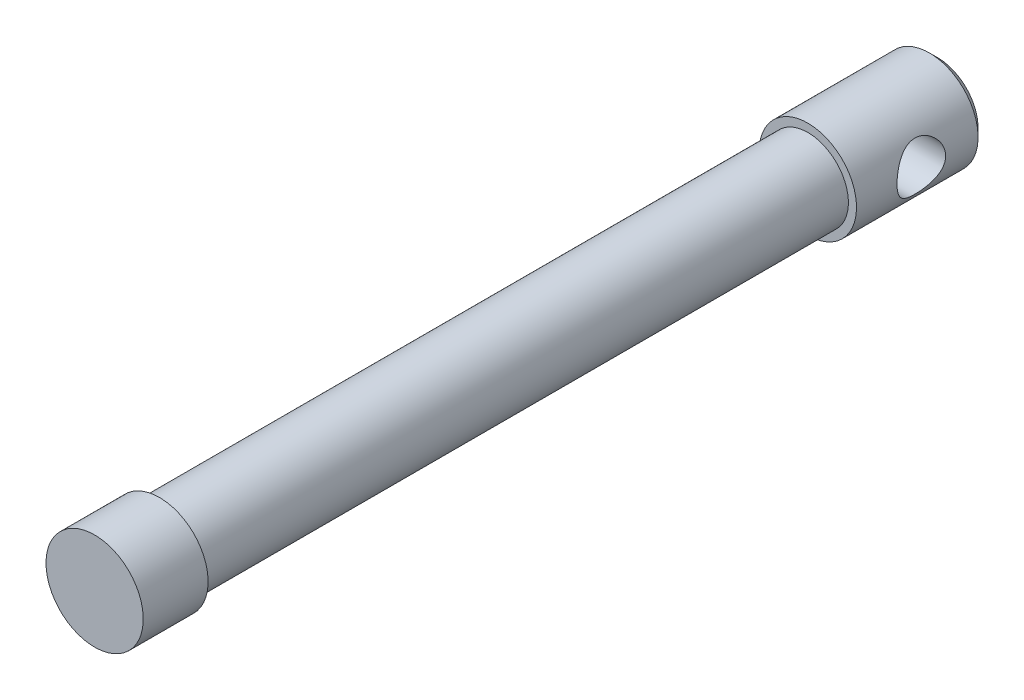
ISO-10303-21;
HEADER;
FILE_DESCRIPTION(('STEP AP214'),'2;1');
FILE_NAME('part.step','',(''),(''),'','','');
FILE_SCHEMA(('AUTOMOTIVE_DESIGN { 1 0 10303 214 1 1 1 1 }'));
ENDSEC;
DATA;
#1=APPLICATION_CONTEXT('core data for automotive mechanical design processes');
#2=APPLICATION_PROTOCOL_DEFINITION('international standard','automotive_design',2000,#1);
#3=PRODUCT_CONTEXT('',#1,'mechanical');
#4=PRODUCT('Part','Part','',(#3));
#5=PRODUCT_RELATED_PRODUCT_CATEGORY('part','',(#4));
#6=PRODUCT_DEFINITION_FORMATION('','',#4);
#7=PRODUCT_DEFINITION_CONTEXT('part definition',#1,'design');
#8=PRODUCT_DEFINITION('design','',#6,#7);
#9=PRODUCT_DEFINITION_SHAPE('','',#8);
#10=(LENGTH_UNIT() NAMED_UNIT(*) SI_UNIT(.MILLI.,.METRE.));
#11=(NAMED_UNIT(*) PLANE_ANGLE_UNIT() SI_UNIT($,.RADIAN.));
#12=(NAMED_UNIT(*) SI_UNIT($,.STERADIAN.) SOLID_ANGLE_UNIT());
#13=UNCERTAINTY_MEASURE_WITH_UNIT(LENGTH_MEASURE(1.E-05),#10,'distance_accuracy_value','');
#14=(GEOMETRIC_REPRESENTATION_CONTEXT(3) GLOBAL_UNCERTAINTY_ASSIGNED_CONTEXT((#13)) GLOBAL_UNIT_ASSIGNED_CONTEXT((#10,
#11,#12)) REPRESENTATION_CONTEXT('',''));
#15=CARTESIAN_POINT('',(0.,0.,0.));
#16=DIRECTION('',(0.,0.,1.));
#17=DIRECTION('',(1.,0.,0.));
#18=AXIS2_PLACEMENT_3D('',#15,#16,#17);
#19=CARTESIAN_POINT('',(0.,0.,0.));
#20=DIRECTION('',(0.,0.,-1.));
#21=DIRECTION('',(-1.,0.,0.));
#22=AXIS2_PLACEMENT_3D('',#19,#20,#21);
#23=PLANE('',#22);
#24=CARTESIAN_POINT('',(0.,0.,0.));
#25=DIRECTION('',(0.,0.,1.));
#26=DIRECTION('',(1.,0.,0.));
#27=AXIS2_PLACEMENT_3D('',#24,#25,#26);
#28=CIRCLE('',#27,9.525);
#29=CARTESIAN_POINT('',(-9.525,0.,0.));
#30=VERTEX_POINT('',#29);
#31=EDGE_CURVE('E112',#30,#30,#28,.T.);
#32=ORIENTED_EDGE('',*,*,#31,.T.);
#33=EDGE_LOOP('',(#32));
#34=FACE_BOUND('',#33,.T.);
#35=ADVANCED_FACE('F40',(#34),#23,.F.);
#36=CARTESIAN_POINT('',(0.,0.,-12.7));
#37=DIRECTION('',(0.,0.,-1.));
#38=DIRECTION('',(-1.,0.,0.));
#39=AXIS2_PLACEMENT_3D('',#36,#37,#38);
#40=PLANE('',#39);
#41=CARTESIAN_POINT('',(0.,0.,-12.7));
#42=DIRECTION('',(0.,0.,-1.));
#43=DIRECTION('',(-1.,0.,0.));
#44=AXIS2_PLACEMENT_3D('',#41,#42,#43);
#45=CIRCLE('',#44,7.9375);
#46=CARTESIAN_POINT('',(-7.9375,0.,-12.7));
#47=VERTEX_POINT('',#46);
#48=EDGE_CURVE('E120',#47,#47,#45,.T.);
#49=ORIENTED_EDGE('',*,*,#48,.F.);
#50=EDGE_LOOP('',(#49));
#51=FACE_BOUND('',#50,.T.);
#52=CARTESIAN_POINT('',(0.,0.,-12.7));
#53=DIRECTION('',(0.,0.,1.));
#54=DIRECTION('',(1.,0.,0.));
#55=AXIS2_PLACEMENT_3D('',#52,#53,#54);
#56=CIRCLE('',#55,9.525);
#57=CARTESIAN_POINT('',(-9.525,0.,-12.7));
#58=VERTEX_POINT('',#57);
#59=EDGE_CURVE('E114',#58,#58,#56,.T.);
#60=ORIENTED_EDGE('',*,*,#59,.F.);
#61=EDGE_LOOP('',(#60));
#62=FACE_BOUND('',#61,.T.);
#63=ADVANCED_FACE('F95',(#51,#62),#40,.T.);
#64=CARTESIAN_POINT('',(0.,0.,0.));
#65=DIRECTION('',(0.,0.,-1.));
#66=DIRECTION('',(-1.,0.,0.));
#67=AXIS2_PLACEMENT_3D('',#64,#65,#66);
#68=CYLINDRICAL_SURFACE('',#67,9.525);
#69=CARTESIAN_POINT('',(-9.525,0.,0.));
#70=CARTESIAN_POINT('',(-9.525,0.,-0.132291666666667));
#71=CARTESIAN_POINT('',(-9.525,0.,-0.264583333333333));
#72=CARTESIAN_POINT('',(-9.525,0.,-0.529166666666666));
#73=CARTESIAN_POINT('',(-9.525,0.,-0.661458333333333));
#74=CARTESIAN_POINT('',(-9.525,0.,-0.926041666666667));
#75=CARTESIAN_POINT('',(-9.525,0.,-1.05833333333333));
#76=CARTESIAN_POINT('',(-9.525,0.,-1.32291666666667));
#77=CARTESIAN_POINT('',(-9.525,0.,-1.45520833333333));
#78=CARTESIAN_POINT('',(-9.525,0.,-1.71979166666667));
#79=CARTESIAN_POINT('',(-9.525,0.,-1.85208333333333));
#80=CARTESIAN_POINT('',(-9.525,0.,-2.11666666666667));
#81=CARTESIAN_POINT('',(-9.525,0.,-2.24895833333333));
#82=CARTESIAN_POINT('',(-9.525,0.,-2.51354166666667));
#83=CARTESIAN_POINT('',(-9.525,0.,-2.64583333333333));
#84=CARTESIAN_POINT('',(-9.525,0.,-2.91041666666667));
#85=CARTESIAN_POINT('',(-9.525,0.,-3.04270833333333));
#86=CARTESIAN_POINT('',(-9.525,0.,-3.30729166666667));
#87=CARTESIAN_POINT('',(-9.525,0.,-3.43958333333333));
#88=CARTESIAN_POINT('',(-9.525,0.,-3.70416666666667));
#89=CARTESIAN_POINT('',(-9.525,0.,-3.83645833333333));
#90=CARTESIAN_POINT('',(-9.525,0.,-4.10104166666667));
#91=CARTESIAN_POINT('',(-9.525,0.,-4.23333333333333));
#92=CARTESIAN_POINT('',(-9.525,0.,-4.49791666666667));
#93=CARTESIAN_POINT('',(-9.525,0.,-4.63020833333333));
#94=CARTESIAN_POINT('',(-9.525,0.,-4.89479166666667));
#95=CARTESIAN_POINT('',(-9.525,0.,-5.02708333333333));
#96=CARTESIAN_POINT('',(-9.525,0.,-5.29166666666667));
#97=CARTESIAN_POINT('',(-9.525,0.,-5.42395833333333));
#98=CARTESIAN_POINT('',(-9.525,0.,-5.68854166666667));
#99=CARTESIAN_POINT('',(-9.525,0.,-5.82083333333333));
#100=CARTESIAN_POINT('',(-9.525,0.,-6.08541666666667));
#101=CARTESIAN_POINT('',(-9.525,0.,-6.21770833333333));
#102=CARTESIAN_POINT('',(-9.525,0.,-6.48229166666667));
#103=CARTESIAN_POINT('',(-9.525,0.,-6.61458333333333));
#104=CARTESIAN_POINT('',(-9.525,0.,-6.87916666666667));
#105=CARTESIAN_POINT('',(-9.525,0.,-7.01145833333333));
#106=CARTESIAN_POINT('',(-9.525,0.,-7.27604166666667));
#107=CARTESIAN_POINT('',(-9.525,0.,-7.40833333333333));
#108=CARTESIAN_POINT('',(-9.525,0.,-7.67291666666667));
#109=CARTESIAN_POINT('',(-9.525,0.,-7.80520833333333));
#110=CARTESIAN_POINT('',(-9.525,0.,-8.06979166666667));
#111=CARTESIAN_POINT('',(-9.525,0.,-8.20208333333333));
#112=CARTESIAN_POINT('',(-9.525,0.,-8.46666666666667));
#113=CARTESIAN_POINT('',(-9.525,0.,-8.59895833333333));
#114=CARTESIAN_POINT('',(-9.525,0.,-8.86354166666666));
#115=CARTESIAN_POINT('',(-9.525,0.,-8.99583333333333));
#116=CARTESIAN_POINT('',(-9.525,0.,-9.26041666666666));
#117=CARTESIAN_POINT('',(-9.525,0.,-9.39270833333333));
#118=CARTESIAN_POINT('',(-9.525,0.,-9.65729166666667));
#119=CARTESIAN_POINT('',(-9.525,0.,-9.78958333333333));
#120=CARTESIAN_POINT('',(-9.525,0.,-10.0541666666667));
#121=CARTESIAN_POINT('',(-9.525,0.,-10.1864583333333));
#122=CARTESIAN_POINT('',(-9.525,0.,-10.4510416666667));
#123=CARTESIAN_POINT('',(-9.525,0.,-10.5833333333333));
#124=CARTESIAN_POINT('',(-9.525,0.,-10.8479166666667));
#125=CARTESIAN_POINT('',(-9.525,0.,-10.9802083333333));
#126=CARTESIAN_POINT('',(-9.525,0.,-11.2447916666667));
#127=CARTESIAN_POINT('',(-9.525,0.,-11.3770833333333));
#128=CARTESIAN_POINT('',(-9.525,0.,-11.6416666666667));
#129=CARTESIAN_POINT('',(-9.525,0.,-11.7739583333333));
#130=CARTESIAN_POINT('',(-9.525,0.,-12.0385416666667));
#131=CARTESIAN_POINT('',(-9.525,0.,-12.1708333333333));
#132=CARTESIAN_POINT('',(-9.525,0.,-12.4354166666667));
#133=CARTESIAN_POINT('',(-9.525,0.,-12.5677083333333));
#134=CARTESIAN_POINT('',(-9.525,0.,-12.7));
#135=B_SPLINE_CURVE_WITH_KNOTS('',3,(#69,#70,#71,#72,#73,#74,#75,#76,#77,#78,#79,#80,#81,#82,
#83,#84,#85,#86,#87,#88,#89,#90,#91,#92,#93,#94,#95,#96,#97,#98,#99,#100,#101,#102,#103,#104,
#105,#106,#107,#108,#109,#110,#111,#112,#113,#114,#115,#116,#117,#118,#119,#120,#121,#122,#123,
#124,#125,#126,#127,#128,#129,#130,#131,#132,#133,#134),.UNSPECIFIED.,.F.,.F.,(4,2,2,2,2,2,2,2,
2,2,2,2,2,2,2,2,2,2,2,2,2,2,2,2,2,2,2,2,2,2,2,2,4),(0.,0.396875,0.79375,1.190625,1.5875,
1.984375,2.38125,2.778125,3.175,3.571875,3.96875,4.365625,4.7625,5.159375,5.55625,5.953125,6.35,
6.746875,7.14375,7.540625,7.9375,8.334375,8.73125,9.128125,9.525,9.921875,10.31875,10.715625,
11.1125,11.509375,11.90625,12.303125,12.7),.UNSPECIFIED.);
#136=EDGE_CURVE('BSEAM92',#30,#58,#135,.T.);
#137=ORIENTED_EDGE('',*,*,#31,.F.);
#138=ORIENTED_EDGE('',*,*,#59,.T.);
#139=ORIENTED_EDGE('',*,*,#136,.T.);
#140=ORIENTED_EDGE('',*,*,#136,.F.);
#141=EDGE_LOOP('',(#137,#139,#138,#140));
#142=FACE_BOUND('',#141,.T.);
#143=ADVANCED_FACE('F92',(#142),#68,.T.);
#144=CARTESIAN_POINT('',(0.,0.,-139.7));
#145=DIRECTION('',(0.,0.,1.));
#146=DIRECTION('',(1.,0.,0.));
#147=AXIS2_PLACEMENT_3D('',#144,#145,#146);
#148=CYLINDRICAL_SURFACE('',#147,7.9375);
#149=CARTESIAN_POINT('',(0.,0.,-139.7));
#150=DIRECTION('',(0.,0.,-1.));
#151=DIRECTION('',(-1.,0.,0.));
#152=AXIS2_PLACEMENT_3D('',#149,#150,#151);
#153=CIRCLE('',#152,7.9375);
#154=CARTESIAN_POINT('',(-7.9375,0.,-139.7));
#155=VERTEX_POINT('',#154);
#156=EDGE_CURVE('E115',#155,#155,#153,.T.);
#157=ORIENTED_EDGE('',*,*,#156,.F.);
#158=EDGE_LOOP('',(#157));
#159=FACE_BOUND('',#158,.T.);
#160=ORIENTED_EDGE('',*,*,#48,.T.);
#161=EDGE_LOOP('',(#160));
#162=FACE_BOUND('',#161,.T.);
#163=ADVANCED_FACE('F94',(#159,#162),#148,.T.);
#164=CARTESIAN_POINT('',(0.,0.,-165.1));
#165=DIRECTION('',(0.,0.,1.));
#166=DIRECTION('',(1.,0.,0.));
#167=AXIS2_PLACEMENT_3D('',#164,#165,#166);
#168=CYLINDRICAL_SURFACE('',#167,9.525);
#169=CARTESIAN_POINT('',(-9.525,0.,-157.1625));
#170=CARTESIAN_POINT('',(-9.52499962063721,0.12524316779999,-157.162499588314));
#171=CARTESIAN_POINT('',(-9.52252400598023,0.250495089131836,-157.157553881541));
#172=CARTESIAN_POINT('',(-9.51268396387997,0.500076393496527,-157.137827493358));
#173=CARTESIAN_POINT('',(-9.50531740964971,0.624405351393148,-157.12304253342));
#174=CARTESIAN_POINT('',(-9.48587193787975,0.87133100126815,-157.083784657548));
#175=CARTESIAN_POINT('',(-9.47378630044847,0.9939249635233,-157.059297925728));
#176=CARTESIAN_POINT('',(-9.44520637539277,1.23637011508467,-157.000907734383));
#177=CARTESIAN_POINT('',(-9.42871028557932,1.35622016139572,-156.967000425221));
#178=CARTESIAN_POINT('',(-9.39179697222459,1.59183120722172,-156.890295995465));
#179=CARTESIAN_POINT('',(-9.37139708461428,1.70760770137534,-156.847538112257));
#180=CARTESIAN_POINT('',(-9.3271126718355,1.93495086483046,-156.75345002009));
#181=CARTESIAN_POINT('',(-9.30322683559748,2.04651593025001,-156.702116584799));
#182=CARTESIAN_POINT('',(-9.22716144615755,2.37384489745524,-156.535945853429));
#183=CARTESIAN_POINT('',(-9.17053150857179,2.58250225923314,-156.408852688455));
#184=CARTESIAN_POINT('',(-9.04666081910159,2.98854538583361,-156.117030969651));
#185=CARTESIAN_POINT('',(-8.97898540114139,3.1844855631296,-155.950490717651));
#186=CARTESIAN_POINT('',(-8.84205954293001,3.54699697455441,-155.588408893268));
#187=CARTESIAN_POINT('',(-8.77280794740667,3.71354582861884,-155.392845427927));
#188=CARTESIAN_POINT('',(-8.63435408613186,4.02553537328568,-154.959867422615));
#189=CARTESIAN_POINT('',(-8.56557212539103,4.16833749963764,-154.720383450744));
#190=CARTESIAN_POINT('',(-8.47379640254791,4.35029005345509,-154.343178061627));
#191=CARTESIAN_POINT('',(-8.4450962651909,4.40557901885788,-154.214399825047));
#192=CARTESIAN_POINT('',(-8.39256904955603,4.50483773649695,-153.951621310878));
#193=CARTESIAN_POINT('',(-8.36873908777993,4.54881419057648,-153.817624179539));
#194=CARTESIAN_POINT('',(-8.32818911059644,4.6226139958286,-153.553484390703));
#195=CARTESIAN_POINT('',(-8.31113119648638,4.65312214328155,-153.423584578092));
#196=CARTESIAN_POINT('',(-8.28290506375683,4.70318378391282,-153.161118312858));
#197=CARTESIAN_POINT('',(-8.27173372047612,4.72274308921004,-153.028553313823));
#198=CARTESIAN_POINT('',(-8.25575723957704,4.7506165346424,-152.761942745545));
#199=CARTESIAN_POINT('',(-8.25094826797975,4.75893744712048,-152.627898117086));
#200=CARTESIAN_POINT('',(-8.2479001730778,4.76421854927813,-152.359518180681));
#201=CARTESIAN_POINT('',(-8.24966042295241,4.76117982286955,-152.225182901689));
#202=CARTESIAN_POINT('',(-8.2590684278093,4.74483797280582,-151.973560536947));
#203=CARTESIAN_POINT('',(-8.2659846789569,4.73280973448219,-151.856161267269));
#204=CARTESIAN_POINT('',(-8.28459407928506,4.70015601149781,-151.622936674255));
#205=CARTESIAN_POINT('',(-8.29628872876442,4.67952782662533,-151.507111857071));
#206=CARTESIAN_POINT('',(-8.33800444414717,4.60506661909893,-151.163203594897));
#207=CARTESIAN_POINT('',(-8.37466460391199,4.53864529577751,-150.938513221415));
#208=CARTESIAN_POINT('',(-8.46236620531704,4.37297035741613,-150.498635772543));
#209=CARTESIAN_POINT('',(-8.51372273880603,4.27298801966148,-150.283791964974));
#210=CARTESIAN_POINT('',(-8.62505005190894,4.04355977442938,-149.872862496087));
#211=CARTESIAN_POINT('',(-8.68502469635284,3.914100632641,-149.676785316827));
#212=CARTESIAN_POINT('',(-8.81601207894059,3.6102994781272,-149.282845068965));
#213=CARTESIAN_POINT('',(-8.88746017331488,3.43234782914615,-149.087907979856));
#214=CARTESIAN_POINT('',(-9.02721381532401,3.04584295330873,-148.72935121853));
#215=CARTESIAN_POINT('',(-9.0955178493011,2.83727518509306,-148.565746513439));
#216=CARTESIAN_POINT('',(-9.19195370403877,2.49965137796344,-148.343834673363));
#217=CARTESIAN_POINT('',(-9.22372787983903,2.38002127368373,-148.272482029683));
#218=CARTESIAN_POINT('',(-9.28366556941997,2.13427687141612,-148.140221786318));
#219=CARTESIAN_POINT('',(-9.31183060399966,2.00816533613018,-148.07930978354));
#220=CARTESIAN_POINT('',(-9.36371844925579,1.75034069526616,-147.968590044518));
#221=CARTESIAN_POINT('',(-9.38744304755807,1.61862987016266,-147.918777838185));
#222=CARTESIAN_POINT('',(-9.42974072645533,1.35056106639509,-147.830833762178));
#223=CARTESIAN_POINT('',(-9.4483143996453,1.21420362433566,-147.792700548827));
#224=CARTESIAN_POINT('',(-9.47841891468132,0.949450109300048,-147.731289279082));
#225=CARTESIAN_POINT('',(-9.49040564136936,0.821329961906903,-147.707042486129));
#226=CARTESIAN_POINT('',(-9.50921741531494,0.563164063018349,-147.669115341185));
#227=CARTESIAN_POINT('',(-9.51604291885923,0.433118482780759,-147.655434055131));
#228=CARTESIAN_POINT('',(-9.52433687415141,0.172222200636555,-147.638820963042));
#229=CARTESIAN_POINT('',(-9.52580737679104,0.0413718261918253,-147.635885041679));
#230=CARTESIAN_POINT('',(-9.52335444060485,-0.220072847166312,-147.64079143419));
#231=CARTESIAN_POINT('',(-9.51943124049279,-0.350667157156422,-147.648633271064));
#232=CARTESIAN_POINT('',(-9.50681651861088,-0.600383632816328,-147.673960436826));
#233=CARTESIAN_POINT('',(-9.49851975936574,-0.719607798059654,-147.690647954656));
#234=CARTESIAN_POINT('',(-9.47763434053446,-0.956123558476329,-147.732916186078));
#235=CARTESIAN_POINT('',(-9.46504432155854,-1.07341452918895,-147.758499716497));
#236=CARTESIAN_POINT('',(-9.43586934009923,-1.30523272581463,-147.818287055902));
#237=CARTESIAN_POINT('',(-9.41928560017321,-1.41976078572846,-147.852488227006));
#238=CARTESIAN_POINT('',(-9.382499981618,-1.64542419391327,-147.92918232366));
#239=CARTESIAN_POINT('',(-9.36229671724176,-1.75655822362736,-147.971678425513));
#240=CARTESIAN_POINT('',(-9.29566539786794,-2.09007412634845,-148.113700286025));
#241=CARTESIAN_POINT('',(-9.24405921515466,-2.30611033108621,-148.22608855655));
#242=CARTESIAN_POINT('',(-9.13180205397676,-2.71685918550571,-148.480988464042));
#243=CARTESIAN_POINT('',(-9.07114722574502,-2.91156269769227,-148.623512933348));
#244=CARTESIAN_POINT('',(-8.93960783885979,-3.29452731372962,-148.950794894712));
#245=CARTESIAN_POINT('',(-8.868303631423,-3.48027815582498,-149.138325286144));
#246=CARTESIAN_POINT('',(-8.72786114875584,-3.81886460963263,-149.54218618662));
#247=CARTESIAN_POINT('',(-8.65872439991558,-3.97167745144758,-149.758536452608));
#248=CARTESIAN_POINT('',(-8.56092960704944,-4.17638881115549,-150.106847264333));
#249=CARTESIAN_POINT('',(-8.52864647367417,-4.24173741059432,-150.230062958003));
#250=CARTESIAN_POINT('',(-8.46793790675362,-4.36167001930206,-150.482516630992));
#251=CARTESIAN_POINT('',(-8.43951072775551,-4.41625890421415,-150.611751849658));
#252=CARTESIAN_POINT('',(-8.3876228681576,-4.51403084118841,-150.875311376147));
#253=CARTESIAN_POINT('',(-8.36415813189979,-4.55722321448888,-151.009631421602));
#254=CARTESIAN_POINT('',(-8.32316235190994,-4.63167416627275,-151.282423218291));
#255=CARTESIAN_POINT('',(-8.30563038948562,-4.66293459251875,-151.420894323113));
#256=CARTESIAN_POINT('',(-8.27866590076995,-4.71062527640279,-151.687306144912));
#257=CARTESIAN_POINT('',(-8.26861751501085,-4.72819092555357,-151.814982008672));
#258=CARTESIAN_POINT('',(-8.25443000373947,-4.75291664228842,-152.071659196527));
#259=CARTESIAN_POINT('',(-8.25029025909993,-4.76007780009146,-152.200660380324));
#260=CARTESIAN_POINT('',(-8.24809207938035,-4.76388567177541,-152.458823471067));
#261=CARTESIAN_POINT('',(-8.25003150672726,-4.76053608147039,-152.587985305559));
#262=CARTESIAN_POINT('',(-8.25990551900989,-4.7433830792926,-152.845375243945));
#263=CARTESIAN_POINT('',(-8.26783985851658,-4.72958009537707,-152.973603385847));
#264=CARTESIAN_POINT('',(-8.28834856879422,-4.69353669139924,-153.215873592556));
#265=CARTESIAN_POINT('',(-8.30040666790682,-4.67222934629289,-153.330099638042));
#266=CARTESIAN_POINT('',(-8.32877048505191,-4.62147643847893,-153.556202784015));
#267=CARTESIAN_POINT('',(-8.34507751652013,-4.5920283591246,-153.668079146591));
#268=CARTESIAN_POINT('',(-8.39966155854959,-4.49189766535448,-153.999168552145));
#269=CARTESIAN_POINT('',(-8.44361545117,-4.4094054780741,-154.213994430474));
#270=CARTESIAN_POINT('',(-8.5452860363426,-4.20916574352959,-154.641385226053));
#271=CARTESIAN_POINT('',(-8.60372898549137,-4.08942191082138,-154.85282854238));
#272=CARTESIAN_POINT('',(-8.72658246261695,-3.82024338512737,-155.25403681439));
#273=CARTESIAN_POINT('',(-8.79099608593483,-3.67079324521368,-155.443790410481));
#274=CARTESIAN_POINT('',(-8.92789150982251,-3.32520368388599,-155.820149235193));
#275=CARTESIAN_POINT('',(-9.0004026516788,-3.12559766366327,-156.003570407876));
#276=CARTESIAN_POINT('',(-9.13818513010387,-2.69626914168463,-156.335096036177));
#277=CARTESIAN_POINT('',(-9.20345255422176,-2.46653050955159,-156.483181455551));
#278=CARTESIAN_POINT('',(-9.29086610240478,-2.10268072495818,-156.675420469837));
#279=CARTESIAN_POINT('',(-9.31834760006229,-1.97763300723182,-156.734700893135));
#280=CARTESIAN_POINT('',(-9.36893044835914,-1.72211552262133,-156.842399188705));
#281=CARTESIAN_POINT('',(-9.39203394996841,-1.59164845695405,-156.89082239743));
#282=CARTESIAN_POINT('',(-9.43312646132604,-1.32654199767925,-156.976139030045));
#283=CARTESIAN_POINT('',(-9.45112661821364,-1.19191242135595,-157.013057601071));
#284=CARTESIAN_POINT('',(-9.48151473751691,-0.91938843852027,-157.075001060446));
#285=CARTESIAN_POINT('',(-9.49390612793916,-0.781496080561076,-157.100033214082));
#286=CARTESIAN_POINT('',(-9.51048759454479,-0.536297175823774,-157.133424491729));
#287=CARTESIAN_POINT('',(-9.51592021375587,-0.429411583767851,-157.144318445392));
#288=CARTESIAN_POINT('',(-9.52317662911679,-0.215019489362879,-157.158856476283));
#289=CARTESIAN_POINT('',(-9.52500032565785,-0.107512969957934,-157.162500353405));
#290=CARTESIAN_POINT('',(-9.525,0.,-157.1625));
#291=B_SPLINE_CURVE_WITH_KNOTS('',3,(#169,#170,#171,#172,#173,#174,#175,#176,#177,#178,#179,
#180,#181,#182,#183,#184,#185,#186,#187,#188,#189,#190,#191,#192,#193,#194,#195,#196,#197,#198,
#199,#200,#201,#202,#203,#204,#205,#206,#207,#208,#209,#210,#211,#212,#213,#214,#215,#216,#217,
#218,#219,#220,#221,#222,#223,#224,#225,#226,#227,#228,#229,#230,#231,#232,#233,#234,#235,#236,
#237,#238,#239,#240,#241,#242,#243,#244,#245,#246,#247,#248,#249,#250,#251,#252,#253,#254,#255,
#256,#257,#258,#259,#260,#261,#262,#263,#264,#265,#266,#267,#268,#269,#270,#271,#272,#273,#274,
#275,#276,#277,#278,#279,#280,#281,#282,#283,#284,#285,#286,#287,#288,#289,#290),.UNSPECIFIED.,
.T.,.F.,(4,2,2,2,2,2,2,2,2,2,2,2,2,2,2,2,2,2,2,2,2,2,2,2,2,2,2,2,2,2,2,2,2,2,2,2,2,2,2,2,2,2,2,
2,2,2,2,2,2,2,2,2,2,2,2,2,2,2,2,2,4),(0.,0.375623418154022,0.751410280296024,1.12773421934006,
1.50421216665563,1.87905550525342,2.25404018794788,3.00318908218551,3.7976597983107,
4.59273287924315,5.44946389368043,5.87811905389962,6.30651967909291,6.70950847539318,
7.1122831444524,7.5148149899085,7.9173084276388,8.27152461989834,8.62585211283934,
9.33399259637596,10.0586277474397,10.7835888844336,11.6004728904415,12.417746144678,
12.8458801890468,13.2738332313566,13.701613616489,14.1293447666274,14.521651524315,
14.913923595397,15.3060454158579,15.698149882404,16.0597456619957,16.4214560413944,
16.7830558344937,17.144794364286,17.8882174899416,18.6319578135026,19.4487341785404,
20.2660733794108,20.6950689367829,21.1238696504806,21.5523185520335,21.9807010777177,
22.3679690015927,22.7551963432538,23.1422875423821,23.5293628950278,23.8794231642634,
24.2295917732494,24.9294696536929,25.6763690993088,26.4236579446131,27.2617475314397,
28.1002876036314,28.5230685284025,28.9456411934234,29.3672836019069,29.7886679587936,
30.1111069020891,30.4335547448009),.UNSPECIFIED.);
#292=CARTESIAN_POINT('',(-9.525,0.,-157.1625));
#293=VERTEX_POINT('',#292);
#294=EDGE_CURVE('E11',#293,#293,#291,.T.);
#295=ORIENTED_EDGE('',*,*,#294,.T.);
#296=EDGE_LOOP('',(#295));
#297=FACE_BOUND('',#296,.T.);
#298=CARTESIAN_POINT('',(9.52499999999999,0.,-157.1625));
#299=CARTESIAN_POINT('',(9.5249996206372,-0.12524316779999,-157.162499588314));
#300=CARTESIAN_POINT('',(9.52252400598023,-0.250495089131837,-157.157553881541));
#301=CARTESIAN_POINT('',(9.51268396387997,-0.500076393496528,-157.137827493358));
#302=CARTESIAN_POINT('',(9.50531740964971,-0.624405351393148,-157.12304253342));
#303=CARTESIAN_POINT('',(9.48587193787975,-0.871331001268151,-157.083784657548));
#304=CARTESIAN_POINT('',(9.47378630044847,-0.993924963523301,-157.059297925728));
#305=CARTESIAN_POINT('',(9.44520637539277,-1.23637011508467,-157.000907734383));
#306=CARTESIAN_POINT('',(9.42871028557932,-1.35622016139572,-156.967000425221));
#307=CARTESIAN_POINT('',(9.39179697222459,-1.59183120722172,-156.890295995465));
#308=CARTESIAN_POINT('',(9.37139708461428,-1.70760770137534,-156.847538112257));
#309=CARTESIAN_POINT('',(9.3271126718355,-1.93495086483047,-156.75345002009));
#310=CARTESIAN_POINT('',(9.30322683559748,-2.04651593025001,-156.702116584799));
#311=CARTESIAN_POINT('',(9.22716144615755,-2.37384489745524,-156.535945853429));
#312=CARTESIAN_POINT('',(9.17053150857179,-2.58250225923314,-156.408852688455));
#313=CARTESIAN_POINT('',(9.04666081910159,-2.98854538583361,-156.117030969651));
#314=CARTESIAN_POINT('',(8.97898540114139,-3.1844855631296,-155.950490717651));
#315=CARTESIAN_POINT('',(8.84205954293001,-3.54699697455441,-155.588408893268));
#316=CARTESIAN_POINT('',(8.77280794740666,-3.71354582861884,-155.392845427927));
#317=CARTESIAN_POINT('',(8.63435408613186,-4.02553537328568,-154.959867422615));
#318=CARTESIAN_POINT('',(8.56557212539103,-4.16833749963764,-154.720383450744));
#319=CARTESIAN_POINT('',(8.47379640254791,-4.35029005345509,-154.343178061627));
#320=CARTESIAN_POINT('',(8.4450962651909,-4.40557901885788,-154.214399825047));
#321=CARTESIAN_POINT('',(8.39256904955603,-4.50483773649695,-153.951621310878));
#322=CARTESIAN_POINT('',(8.36873908777993,-4.54881419057648,-153.817624179539));
#323=CARTESIAN_POINT('',(8.32818911059644,-4.6226139958286,-153.553484390703));
#324=CARTESIAN_POINT('',(8.31113119648638,-4.65312214328155,-153.423584578092));
#325=CARTESIAN_POINT('',(8.28290506375683,-4.70318378391282,-153.161118312858));
#326=CARTESIAN_POINT('',(8.27173372047612,-4.72274308921004,-153.028553313823));
#327=CARTESIAN_POINT('',(8.25575723957704,-4.7506165346424,-152.761942745545));
#328=CARTESIAN_POINT('',(8.25094826797975,-4.75893744712048,-152.627898117086));
#329=CARTESIAN_POINT('',(8.2479001730778,-4.76421854927813,-152.359518180681));
#330=CARTESIAN_POINT('',(8.24966042295241,-4.76117982286955,-152.225182901689));
#331=CARTESIAN_POINT('',(8.2590684278093,-4.74483797280582,-151.973560536947));
#332=CARTESIAN_POINT('',(8.2659846789569,-4.73280973448219,-151.856161267269));
#333=CARTESIAN_POINT('',(8.28459407928506,-4.70015601149781,-151.622936674255));
#334=CARTESIAN_POINT('',(8.29628872876442,-4.67952782662533,-151.507111857071));
#335=CARTESIAN_POINT('',(8.33800444414717,-4.60506661909893,-151.163203594897));
#336=CARTESIAN_POINT('',(8.37466460391199,-4.53864529577751,-150.938513221415));
#337=CARTESIAN_POINT('',(8.46236620531704,-4.37297035741613,-150.498635772543));
#338=CARTESIAN_POINT('',(8.51372273880603,-4.27298801966148,-150.283791964974));
#339=CARTESIAN_POINT('',(8.62505005190894,-4.04355977442938,-149.872862496087));
#340=CARTESIAN_POINT('',(8.68502469635284,-3.914100632641,-149.676785316827));
#341=CARTESIAN_POINT('',(8.81601207894059,-3.6102994781272,-149.282845068965));
#342=CARTESIAN_POINT('',(8.88746017331488,-3.43234782914615,-149.087907979856));
#343=CARTESIAN_POINT('',(9.02721381532401,-3.04584295330872,-148.72935121853));
#344=CARTESIAN_POINT('',(9.0955178493011,-2.83727518509306,-148.565746513439));
#345=CARTESIAN_POINT('',(9.19195370403877,-2.49965137796344,-148.343834673363));
#346=CARTESIAN_POINT('',(9.22372787983903,-2.38002127368373,-148.272482029683));
#347=CARTESIAN_POINT('',(9.28366556941997,-2.13427687141612,-148.140221786318));
#348=CARTESIAN_POINT('',(9.31183060399966,-2.00816533613018,-148.07930978354));
#349=CARTESIAN_POINT('',(9.36371844925579,-1.75034069526615,-147.968590044518));
#350=CARTESIAN_POINT('',(9.38744304755807,-1.61862987016266,-147.918777838185));
#351=CARTESIAN_POINT('',(9.42974072645533,-1.35056106639509,-147.830833762178));
#352=CARTESIAN_POINT('',(9.44831439964529,-1.21420362433566,-147.792700548827));
#353=CARTESIAN_POINT('',(9.47841891468132,-0.949450109300046,-147.731289279082));
#354=CARTESIAN_POINT('',(9.49040564136936,-0.8213299619069,-147.707042486129));
#355=CARTESIAN_POINT('',(9.50921741531494,-0.563164063018345,-147.669115341185));
#356=CARTESIAN_POINT('',(9.51604291885924,-0.433118482780756,-147.655434055131));
#357=CARTESIAN_POINT('',(9.52433687415141,-0.172222200636554,-147.638820963042));
#358=CARTESIAN_POINT('',(9.52580737679104,-0.0413718261918235,-147.635885041679));
#359=CARTESIAN_POINT('',(9.52335444060485,0.220072847166314,-147.64079143419));
#360=CARTESIAN_POINT('',(9.51943124049279,0.350667157156424,-147.648633271064));
#361=CARTESIAN_POINT('',(9.50681651861088,0.60038363281633,-147.673960436826));
#362=CARTESIAN_POINT('',(9.49851975936574,0.719607798059656,-147.690647954656));
#363=CARTESIAN_POINT('',(9.47763434053446,0.956123558476331,-147.732916186078));
#364=CARTESIAN_POINT('',(9.46504432155853,1.07341452918895,-147.758499716497));
#365=CARTESIAN_POINT('',(9.43586934009923,1.30523272581463,-147.818287055902));
#366=CARTESIAN_POINT('',(9.41928560017321,1.41976078572847,-147.852488227006));
#367=CARTESIAN_POINT('',(9.382499981618,1.64542419391327,-147.92918232366));
#368=CARTESIAN_POINT('',(9.36229671724175,1.75655822362736,-147.971678425513));
#369=CARTESIAN_POINT('',(9.29566539786794,2.09007412634846,-148.113700286025));
#370=CARTESIAN_POINT('',(9.24405921515465,2.30611033108621,-148.22608855655));
#371=CARTESIAN_POINT('',(9.13180205397676,2.71685918550571,-148.480988464042));
#372=CARTESIAN_POINT('',(9.07114722574502,2.91156269769228,-148.623512933348));
#373=CARTESIAN_POINT('',(8.93960783885978,3.29452731372964,-148.950794894712));
#374=CARTESIAN_POINT('',(8.86830363142299,3.48027815582501,-149.138325286144));
#375=CARTESIAN_POINT('',(8.72786114875582,3.81886460963267,-149.54218618662));
#376=CARTESIAN_POINT('',(8.65872439991557,3.97167745144761,-149.758536452608));
#377=CARTESIAN_POINT('',(8.56092960704943,4.1763888111555,-150.106847264333));
#378=CARTESIAN_POINT('',(8.52864647367417,4.24173741059433,-150.230062958003));
#379=CARTESIAN_POINT('',(8.46793790675362,4.36167001930207,-150.482516630992));
#380=CARTESIAN_POINT('',(8.43951072775551,4.41625890421416,-150.611751849658));
#381=CARTESIAN_POINT('',(8.3876228681576,4.51403084118842,-150.875311376147));
#382=CARTESIAN_POINT('',(8.36415813189979,4.55722321448888,-151.009631421602));
#383=CARTESIAN_POINT('',(8.32316235190994,4.63167416627275,-151.282423218291));
#384=CARTESIAN_POINT('',(8.30563038948562,4.66293459251875,-151.420894323113));
#385=CARTESIAN_POINT('',(8.27866590076995,4.71062527640279,-151.687306144912));
#386=CARTESIAN_POINT('',(8.26861751501085,4.72819092555357,-151.814982008672));
#387=CARTESIAN_POINT('',(8.25443000373947,4.75291664228842,-152.071659196527));
#388=CARTESIAN_POINT('',(8.25029025909993,4.76007780009146,-152.200660380324));
#389=CARTESIAN_POINT('',(8.24809207938035,4.76388567177541,-152.458823471067));
#390=CARTESIAN_POINT('',(8.25003150672726,4.76053608147039,-152.587985305559));
#391=CARTESIAN_POINT('',(8.25990551900989,4.7433830792926,-152.845375243945));
#392=CARTESIAN_POINT('',(8.26783985851658,4.72958009537707,-152.973603385847));
#393=CARTESIAN_POINT('',(8.28834856879422,4.69353669139924,-153.215873592556));
#394=CARTESIAN_POINT('',(8.30040666790682,4.67222934629289,-153.330099638042));
#395=CARTESIAN_POINT('',(8.32877048505191,4.62147643847893,-153.556202784015));
#396=CARTESIAN_POINT('',(8.34507751652013,4.5920283591246,-153.668079146591));
#397=CARTESIAN_POINT('',(8.39966155854959,4.49189766535448,-153.999168552145));
#398=CARTESIAN_POINT('',(8.44361545117,4.4094054780741,-154.213994430474));
#399=CARTESIAN_POINT('',(8.5452860363426,4.20916574352959,-154.641385226053));
#400=CARTESIAN_POINT('',(8.60372898549137,4.08942191082138,-154.85282854238));
#401=CARTESIAN_POINT('',(8.72658246261695,3.82024338512737,-155.25403681439));
#402=CARTESIAN_POINT('',(8.79099608593483,3.67079324521368,-155.443790410481));
#403=CARTESIAN_POINT('',(8.92789150982251,3.32520368388599,-155.820149235193));
#404=CARTESIAN_POINT('',(9.0004026516788,3.12559766366327,-156.003570407876));
#405=CARTESIAN_POINT('',(9.13818513010387,2.69626914168463,-156.335096036177));
#406=CARTESIAN_POINT('',(9.20345255422176,2.46653050955159,-156.483181455551));
#407=CARTESIAN_POINT('',(9.29086610240478,2.10268072495818,-156.675420469837));
#408=CARTESIAN_POINT('',(9.31834760006229,1.97763300723183,-156.734700893135));
#409=CARTESIAN_POINT('',(9.36893044835914,1.72211552262134,-156.842399188705));
#410=CARTESIAN_POINT('',(9.39203394996841,1.59164845695406,-156.89082239743));
#411=CARTESIAN_POINT('',(9.43312646132604,1.32654199767925,-156.976139030045));
#412=CARTESIAN_POINT('',(9.45112661821364,1.19191242135595,-157.013057601071));
#413=CARTESIAN_POINT('',(9.48151473751691,0.919388438520274,-157.075001060446));
#414=CARTESIAN_POINT('',(9.49390612793915,0.78149608056108,-157.100033214082));
#415=CARTESIAN_POINT('',(9.51048759454479,0.536297175823776,-157.133424491729));
#416=CARTESIAN_POINT('',(9.51592021375587,0.429411583767852,-157.144318445392));
#417=CARTESIAN_POINT('',(9.52317662911679,0.21501948936288,-157.158856476283));
#418=CARTESIAN_POINT('',(9.52500032565784,0.107512969957935,-157.162500353405));
#419=CARTESIAN_POINT('',(9.52499999999999,0.,-157.1625));
#420=B_SPLINE_CURVE_WITH_KNOTS('',3,(#298,#299,#300,#301,#302,#303,#304,#305,#306,#307,#308,
#309,#310,#311,#312,#313,#314,#315,#316,#317,#318,#319,#320,#321,#322,#323,#324,#325,#326,#327,
#328,#329,#330,#331,#332,#333,#334,#335,#336,#337,#338,#339,#340,#341,#342,#343,#344,#345,#346,
#347,#348,#349,#350,#351,#352,#353,#354,#355,#356,#357,#358,#359,#360,#361,#362,#363,#364,#365,
#366,#367,#368,#369,#370,#371,#372,#373,#374,#375,#376,#377,#378,#379,#380,#381,#382,#383,#384,
#385,#386,#387,#388,#389,#390,#391,#392,#393,#394,#395,#396,#397,#398,#399,#400,#401,#402,#403,
#404,#405,#406,#407,#408,#409,#410,#411,#412,#413,#414,#415,#416,#417,#418,#419),.UNSPECIFIED.,
.T.,.F.,(4,2,2,2,2,2,2,2,2,2,2,2,2,2,2,2,2,2,2,2,2,2,2,2,2,2,2,2,2,2,2,2,2,2,2,2,2,2,2,2,2,2,2,
2,2,2,2,2,2,2,2,2,2,2,2,2,2,2,2,2,4),(0.,0.375623418154023,0.751410280296025,1.12773421934006,
1.50421216665563,1.87905550525342,2.25404018794788,3.00318908218551,3.7976597983107,
4.59273287924315,5.44946389368043,5.87811905389962,6.30651967909291,6.70950847539318,
7.1122831444524,7.5148149899085,7.9173084276388,8.27152461989834,8.62585211283934,
9.33399259637596,10.0586277474397,10.7835888844336,11.6004728904415,12.417746144678,
12.8458801890468,13.2738332313566,13.701613616489,14.1293447666274,14.521651524315,
14.913923595397,15.3060454158579,15.698149882404,16.0597456619957,16.4214560413944,
16.7830558344937,17.144794364286,17.8882174899416,18.6319578135026,19.4487341785405,
20.2660733794109,20.6950689367829,21.1238696504806,21.5523185520335,21.9807010777177,
22.3679690015927,22.7551963432538,23.1422875423821,23.5293628950278,23.8794231642634,
24.2295917732494,24.9294696536929,25.6763690993088,26.4236579446131,27.2617475314397,
28.1002876036314,28.5230685284025,28.9456411934234,29.3672836019069,29.7886679587936,
30.1111069020891,30.4335547448009),.UNSPECIFIED.);
#421=CARTESIAN_POINT('',(9.52499999999999,0.,-157.1625));
#422=VERTEX_POINT('',#421);
#423=EDGE_CURVE('E54',#422,#422,#420,.T.);
#424=ORIENTED_EDGE('',*,*,#423,.T.);
#425=EDGE_LOOP('',(#424));
#426=FACE_BOUND('',#425,.T.);
#427=CARTESIAN_POINT('',(0.,0.,-163.5125));
#428=DIRECTION('',(0.,0.,-1.));
#429=DIRECTION('',(-1.,0.,0.));
#430=AXIS2_PLACEMENT_3D('',#427,#428,#429);
#431=CIRCLE('',#430,9.525);
#432=CARTESIAN_POINT('',(-9.525,0.,-163.5125));
#433=VERTEX_POINT('',#432);
#434=EDGE_CURVE('E59',#433,#433,#431,.F.);
#435=ORIENTED_EDGE('',*,*,#434,.T.);
#436=EDGE_LOOP('',(#435));
#437=FACE_BOUND('',#436,.T.);
#438=CARTESIAN_POINT('',(0.,0.,-139.7));
#439=DIRECTION('',(0.,0.,-1.));
#440=DIRECTION('',(-1.,0.,0.));
#441=AXIS2_PLACEMENT_3D('',#438,#439,#440);
#442=CIRCLE('',#441,9.525);
#443=CARTESIAN_POINT('',(-9.525,0.,-139.7));
#444=VERTEX_POINT('',#443);
#445=EDGE_CURVE('E122',#444,#444,#442,.T.);
#446=ORIENTED_EDGE('',*,*,#445,.T.);
#447=EDGE_LOOP('',(#446));
#448=FACE_BOUND('',#447,.T.);
#449=ADVANCED_FACE('F70',(#297,#426,#437,#448),#168,.T.);
#450=CARTESIAN_POINT('',(0.,0.,-165.1));
#451=DIRECTION('',(0.,0.,-1.));
#452=DIRECTION('',(-1.,0.,0.));
#453=AXIS2_PLACEMENT_3D('',#450,#451,#452);
#454=PLANE('',#453);
#455=CARTESIAN_POINT('',(0.,0.,-165.1));
#456=DIRECTION('',(0.,0.,-1.));
#457=DIRECTION('',(-1.,0.,0.));
#458=AXIS2_PLACEMENT_3D('',#455,#456,#457);
#459=CIRCLE('',#458,7.9375);
#460=CARTESIAN_POINT('',(-7.9375,0.,-165.1));
#461=VERTEX_POINT('',#460);
#462=EDGE_CURVE('E64',#461,#461,#459,.T.);
#463=ORIENTED_EDGE('',*,*,#462,.T.);
#464=EDGE_LOOP('',(#463));
#465=FACE_BOUND('',#464,.T.);
#466=ADVANCED_FACE('F79',(#465),#454,.T.);
#467=CARTESIAN_POINT('',(0.,0.,-139.7));
#468=DIRECTION('',(0.,0.,-1.));
#469=DIRECTION('',(-1.,0.,0.));
#470=AXIS2_PLACEMENT_3D('',#467,#468,#469);
#471=PLANE('',#470);
#472=ORIENTED_EDGE('',*,*,#156,.T.);
#473=EDGE_LOOP('',(#472));
#474=FACE_BOUND('',#473,.T.);
#475=ORIENTED_EDGE('',*,*,#445,.F.);
#476=EDGE_LOOP('',(#475));
#477=FACE_BOUND('',#476,.T.);
#478=ADVANCED_FACE('F82',(#474,#477),#471,.F.);
#479=CARTESIAN_POINT('',(0.,0.,-165.1));
#480=DIRECTION('',(0.,0.,1.));
#481=DIRECTION('',(1.,0.,0.));
#482=AXIS2_PLACEMENT_3D('',#479,#480,#481);
#483=CONICAL_SURFACE('',#482,7.9375,0.78539816339746);
#484=ORIENTED_EDGE('',*,*,#434,.F.);
#485=EDGE_LOOP('',(#484));
#486=FACE_BOUND('',#485,.T.);
#487=ORIENTED_EDGE('',*,*,#462,.F.);
#488=EDGE_LOOP('',(#487));
#489=FACE_BOUND('',#488,.T.);
#490=ADVANCED_FACE('F43',(#486,#489),#483,.T.);
#491=CARTESIAN_POINT('',(-9.525,0.,-152.4));
#492=DIRECTION('',(1.,0.,0.));
#493=DIRECTION('',(0.,0.,-1.));
#494=AXIS2_PLACEMENT_3D('',#491,#492,#493);
#495=CYLINDRICAL_SURFACE('',#494,4.76250000000001);
#496=ORIENTED_EDGE('',*,*,#423,.F.);
#497=EDGE_LOOP('',(#496));
#498=FACE_BOUND('',#497,.T.);
#499=ORIENTED_EDGE('',*,*,#294,.F.);
#500=EDGE_LOOP('',(#499));
#501=FACE_BOUND('',#500,.T.);
#502=ADVANCED_FACE('F74',(#498,#501),#495,.F.);
#503=CLOSED_SHELL('',(#35,#63,#143,#163,#449,#466,#478,#490,#502));
#504=MANIFOLD_SOLID_BREP('B2',#503);
#505=ADVANCED_BREP_SHAPE_REPRESENTATION('',(#18,#504),#14);
#506=SHAPE_DEFINITION_REPRESENTATION(#9,#505);
ENDSEC;
END-ISO-10303-21;
